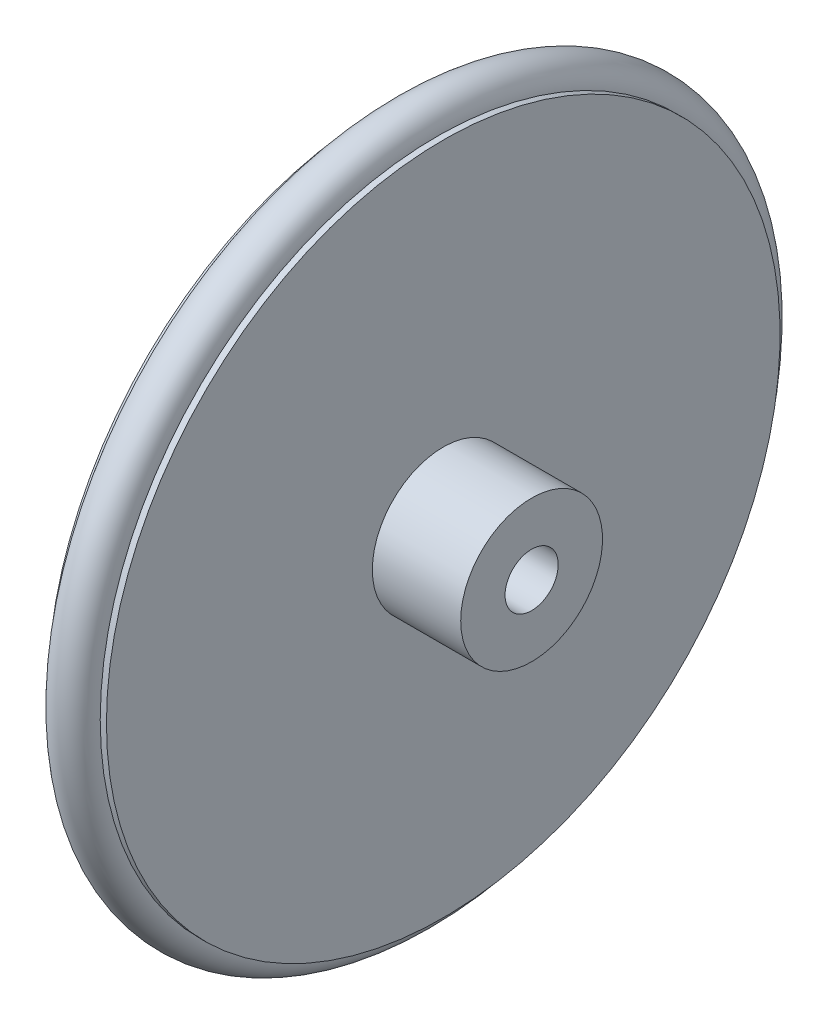
ISO-10303-21;
HEADER;
FILE_DESCRIPTION(('STEP AP214'),'2;1');
FILE_NAME('part.step','',(''),(''),'','','');
FILE_SCHEMA(('AUTOMOTIVE_DESIGN { 1 0 10303 214 1 1 1 1 }'));
ENDSEC;
DATA;
#1=APPLICATION_CONTEXT('core data for automotive mechanical design processes');
#2=APPLICATION_PROTOCOL_DEFINITION('international standard','automotive_design',2000,#1);
#3=PRODUCT_CONTEXT('',#1,'mechanical');
#4=PRODUCT('Part','Part','',(#3));
#5=PRODUCT_RELATED_PRODUCT_CATEGORY('part','',(#4));
#6=PRODUCT_DEFINITION_FORMATION('','',#4);
#7=PRODUCT_DEFINITION_CONTEXT('part definition',#1,'design');
#8=PRODUCT_DEFINITION('design','',#6,#7);
#9=PRODUCT_DEFINITION_SHAPE('','',#8);
#10=(LENGTH_UNIT() NAMED_UNIT(*) SI_UNIT(.MILLI.,.METRE.));
#11=(NAMED_UNIT(*) PLANE_ANGLE_UNIT() SI_UNIT($,.RADIAN.));
#12=(NAMED_UNIT(*) SI_UNIT($,.STERADIAN.) SOLID_ANGLE_UNIT());
#13=UNCERTAINTY_MEASURE_WITH_UNIT(LENGTH_MEASURE(1.E-05),#10,'distance_accuracy_value','');
#14=(GEOMETRIC_REPRESENTATION_CONTEXT(3) GLOBAL_UNCERTAINTY_ASSIGNED_CONTEXT((#13)) GLOBAL_UNIT_ASSIGNED_CONTEXT((#10,
#11,#12)) REPRESENTATION_CONTEXT('',''));
#15=CARTESIAN_POINT('',(0.,0.,0.));
#16=DIRECTION('',(0.,0.,1.));
#17=DIRECTION('',(1.,0.,0.));
#18=AXIS2_PLACEMENT_3D('',#15,#16,#17);
#19=CARTESIAN_POINT('',(3.30000000000003,0.,0.));
#20=DIRECTION('',(-1.,0.,0.));
#21=DIRECTION('',(0.,0.,1.));
#22=AXIS2_PLACEMENT_3D('',#19,#20,#21);
#23=TOROIDAL_SURFACE('',#22,38.,2.5);
#24=CARTESIAN_POINT('',(3.30000000000003,38.,0.));
#25=DIRECTION('',(0.,0.,1.));
#26=DIRECTION('',(1.,0.,0.));
#27=AXIS2_PLACEMENT_3D('',#24,#25,#26);
#28=CIRCLE('',#27,2.5);
#29=CARTESIAN_POINT('',(3.30000000000003,40.5,0.));
#30=VERTEX_POINT('',#29);
#31=EDGE_CURVE('E11',#30,#30,#28,.T.);
#32=CARTESIAN_POINT('',(3.30000000000003,0.,0.));
#33=DIRECTION('',(-1.,0.,0.));
#34=DIRECTION('',(0.,0.,1.));
#35=AXIS2_PLACEMENT_3D('',#32,#33,#34);
#36=CIRCLE('',#35,40.5);
#37=EDGE_CURVE('',#30,#30,#36,.T.);
#38=ORIENTED_EDGE('',*,*,#31,.F.);
#39=ORIENTED_EDGE('',*,*,#31,.T.);
#40=ORIENTED_EDGE('',*,*,#37,.T.);
#41=ORIENTED_EDGE('',*,*,#37,.F.);
#42=EDGE_LOOP('',(#38,#40,#39,#41));
#43=FACE_BOUND('',#42,.T.);
#44=ADVANCED_FACE('F41',(#43),#23,.T.);
#45=CLOSED_SHELL('',(#44));
#46=MANIFOLD_SOLID_BREP('B2',#45);
#47=CARTESIAN_POINT('',(0.,38.,0.));
#48=DIRECTION('',(1.,0.,0.));
#49=DIRECTION('',(0.,0.,-1.));
#50=AXIS2_PLACEMENT_3D('',#47,#48,#49);
#51=PLANE('',#50);
#52=CARTESIAN_POINT('',(0.,0.,0.));
#53=DIRECTION('',(1.,0.,0.));
#54=DIRECTION('',(0.,0.,-1.));
#55=AXIS2_PLACEMENT_3D('',#52,#53,#54);
#56=CIRCLE('',#55,3.);
#57=CARTESIAN_POINT('',(0.,0.,-3.));
#58=VERTEX_POINT('',#57);
#59=EDGE_CURVE('E101',#58,#58,#56,.T.);
#60=ORIENTED_EDGE('',*,*,#59,.T.);
#61=EDGE_LOOP('',(#60));
#62=FACE_BOUND('',#61,.T.);
#63=CARTESIAN_POINT('',(0.,0.,0.));
#64=DIRECTION('',(-1.,0.,0.));
#65=DIRECTION('',(0.,0.,1.));
#66=AXIS2_PLACEMENT_3D('',#63,#64,#65);
#67=CIRCLE('',#66,38.);
#68=CARTESIAN_POINT('',(0.,0.,38.));
#69=VERTEX_POINT('',#68);
#70=EDGE_CURVE('E98',#69,#69,#67,.T.);
#71=ORIENTED_EDGE('',*,*,#70,.T.);
#72=EDGE_LOOP('',(#71));
#73=FACE_BOUND('',#72,.T.);
#74=ADVANCED_FACE('F70',(#62,#73),#51,.F.);
#75=CARTESIAN_POINT('',(16.57,0.,0.));
#76=DIRECTION('',(-1.,0.,0.));
#77=DIRECTION('',(0.,0.,1.));
#78=AXIS2_PLACEMENT_3D('',#75,#76,#77);
#79=PLANE('',#78);
#80=CARTESIAN_POINT('',(16.57,0.,0.));
#81=DIRECTION('',(1.,0.,0.));
#82=DIRECTION('',(0.,0.,-1.));
#83=AXIS2_PLACEMENT_3D('',#80,#81,#82);
#84=CIRCLE('',#83,3.);
#85=CARTESIAN_POINT('',(16.57,0.,-3.));
#86=VERTEX_POINT('',#85);
#87=EDGE_CURVE('E102',#86,#86,#84,.T.);
#88=ORIENTED_EDGE('',*,*,#87,.F.);
#89=EDGE_LOOP('',(#88));
#90=FACE_BOUND('',#89,.T.);
#91=CARTESIAN_POINT('',(16.57,0.,0.));
#92=DIRECTION('',(-1.,0.,0.));
#93=DIRECTION('',(0.,0.,1.));
#94=AXIS2_PLACEMENT_3D('',#91,#92,#93);
#95=CIRCLE('',#94,8.);
#96=CARTESIAN_POINT('',(16.57,0.,8.));
#97=VERTEX_POINT('',#96);
#98=EDGE_CURVE('E40',#97,#97,#95,.T.);
#99=ORIENTED_EDGE('',*,*,#98,.F.);
#100=EDGE_LOOP('',(#99));
#101=FACE_BOUND('',#100,.T.);
#102=ADVANCED_FACE('F117',(#90,#101),#79,.F.);
#103=CARTESIAN_POINT('',(-19.9450853035614,0.,0.));
#104=DIRECTION('',(-1.,0.,0.));
#105=DIRECTION('',(0.,0.,1.));
#106=AXIS2_PLACEMENT_3D('',#103,#104,#105);
#107=CYLINDRICAL_SURFACE('',#106,8.);
#108=CARTESIAN_POINT('',(6.6,0.,0.));
#109=DIRECTION('',(-1.,0.,0.));
#110=DIRECTION('',(0.,0.,1.));
#111=AXIS2_PLACEMENT_3D('',#108,#109,#110);
#112=CIRCLE('',#111,8.);
#113=CARTESIAN_POINT('',(6.6,0.,8.));
#114=VERTEX_POINT('',#113);
#115=EDGE_CURVE('E76',#114,#114,#112,.T.);
#116=ORIENTED_EDGE('',*,*,#115,.F.);
#117=EDGE_LOOP('',(#116));
#118=FACE_BOUND('',#117,.T.);
#119=ORIENTED_EDGE('',*,*,#98,.T.);
#120=EDGE_LOOP('',(#119));
#121=FACE_BOUND('',#120,.T.);
#122=ADVANCED_FACE('F120',(#118,#121),#107,.T.);
#123=CARTESIAN_POINT('',(6.6,8.,0.));
#124=DIRECTION('',(-1.,0.,0.));
#125=DIRECTION('',(0.,0.,1.));
#126=AXIS2_PLACEMENT_3D('',#123,#124,#125);
#127=PLANE('',#126);
#128=CARTESIAN_POINT('',(6.6,0.,0.));
#129=DIRECTION('',(-1.,0.,0.));
#130=DIRECTION('',(0.,0.,1.));
#131=AXIS2_PLACEMENT_3D('',#128,#129,#130);
#132=CIRCLE('',#131,38.);
#133=CARTESIAN_POINT('',(6.6,0.,38.));
#134=VERTEX_POINT('',#133);
#135=EDGE_CURVE('E80',#134,#134,#132,.T.);
#136=ORIENTED_EDGE('',*,*,#135,.F.);
#137=EDGE_LOOP('',(#136));
#138=FACE_BOUND('',#137,.T.);
#139=ORIENTED_EDGE('',*,*,#115,.T.);
#140=EDGE_LOOP('',(#139));
#141=FACE_BOUND('',#140,.T.);
#142=ADVANCED_FACE('F125',(#138,#141),#127,.F.);
#143=CARTESIAN_POINT('',(-19.9450853035614,0.,0.));
#144=DIRECTION('',(-1.,0.,0.));
#145=DIRECTION('',(0.,0.,1.));
#146=AXIS2_PLACEMENT_3D('',#143,#144,#145);
#147=CYLINDRICAL_SURFACE('',#146,38.);
#148=CARTESIAN_POINT('',(5.9,0.,0.));
#149=DIRECTION('',(-1.,0.,0.));
#150=DIRECTION('',(0.,0.,1.));
#151=AXIS2_PLACEMENT_3D('',#148,#149,#150);
#152=CIRCLE('',#151,38.);
#153=CARTESIAN_POINT('',(5.9,0.,38.));
#154=VERTEX_POINT('',#153);
#155=EDGE_CURVE('E84',#154,#154,#152,.T.);
#156=ORIENTED_EDGE('',*,*,#155,.F.);
#157=EDGE_LOOP('',(#156));
#158=FACE_BOUND('',#157,.T.);
#159=ORIENTED_EDGE('',*,*,#135,.T.);
#160=EDGE_LOOP('',(#159));
#161=FACE_BOUND('',#160,.T.);
#162=ADVANCED_FACE('F131',(#158,#161),#147,.T.);
#163=CARTESIAN_POINT('',(5.90000000000003,38.,0.));
#164=DIRECTION('',(1.,0.,0.));
#165=DIRECTION('',(0.,0.,-1.));
#166=AXIS2_PLACEMENT_3D('',#163,#164,#165);
#167=PLANE('',#166);
#168=CARTESIAN_POINT('',(5.90000000000004,0.,0.));
#169=DIRECTION('',(-1.,0.,0.));
#170=DIRECTION('',(0.,0.,1.));
#171=AXIS2_PLACEMENT_3D('',#168,#169,#170);
#172=CIRCLE('',#171,35.);
#173=CARTESIAN_POINT('',(5.90000000000004,0.,35.));
#174=VERTEX_POINT('',#173);
#175=EDGE_CURVE('E89',#174,#174,#172,.T.);
#176=ORIENTED_EDGE('',*,*,#175,.F.);
#177=EDGE_LOOP('',(#176));
#178=FACE_BOUND('',#177,.T.);
#179=ORIENTED_EDGE('',*,*,#155,.T.);
#180=EDGE_LOOP('',(#179));
#181=FACE_BOUND('',#180,.T.);
#182=ADVANCED_FACE('F135',(#178,#181),#167,.F.);
#183=CARTESIAN_POINT('',(-19.9450853035614,0.,0.));
#184=DIRECTION('',(-1.,0.,0.));
#185=DIRECTION('',(0.,0.,1.));
#186=AXIS2_PLACEMENT_3D('',#183,#184,#185);
#187=CYLINDRICAL_SURFACE('',#186,35.);
#188=CARTESIAN_POINT('',(0.700000000000041,0.,0.));
#189=DIRECTION('',(-1.,0.,0.));
#190=DIRECTION('',(0.,0.,1.));
#191=AXIS2_PLACEMENT_3D('',#188,#189,#190);
#192=CIRCLE('',#191,35.);
#193=CARTESIAN_POINT('',(0.700000000000041,0.,35.));
#194=VERTEX_POINT('',#193);
#195=EDGE_CURVE('E92',#194,#194,#192,.T.);
#196=ORIENTED_EDGE('',*,*,#195,.F.);
#197=EDGE_LOOP('',(#196));
#198=FACE_BOUND('',#197,.T.);
#199=ORIENTED_EDGE('',*,*,#175,.T.);
#200=EDGE_LOOP('',(#199));
#201=FACE_BOUND('',#200,.T.);
#202=ADVANCED_FACE('F139',(#198,#201),#187,.T.);
#203=CARTESIAN_POINT('',(0.700000000000042,35.,0.));
#204=DIRECTION('',(-1.,0.,0.));
#205=DIRECTION('',(0.,0.,1.));
#206=AXIS2_PLACEMENT_3D('',#203,#204,#205);
#207=PLANE('',#206);
#208=CARTESIAN_POINT('',(0.700000000000041,0.,0.));
#209=DIRECTION('',(-1.,0.,0.));
#210=DIRECTION('',(0.,0.,1.));
#211=AXIS2_PLACEMENT_3D('',#208,#209,#210);
#212=CIRCLE('',#211,38.);
#213=CARTESIAN_POINT('',(0.700000000000041,0.,38.));
#214=VERTEX_POINT('',#213);
#215=EDGE_CURVE('E95',#214,#214,#212,.T.);
#216=ORIENTED_EDGE('',*,*,#215,.F.);
#217=EDGE_LOOP('',(#216));
#218=FACE_BOUND('',#217,.T.);
#219=ORIENTED_EDGE('',*,*,#195,.T.);
#220=EDGE_LOOP('',(#219));
#221=FACE_BOUND('',#220,.T.);
#222=ADVANCED_FACE('F143',(#218,#221),#207,.F.);
#223=CARTESIAN_POINT('',(-19.9450853035614,0.,0.));
#224=DIRECTION('',(-1.,0.,0.));
#225=DIRECTION('',(0.,0.,1.));
#226=AXIS2_PLACEMENT_3D('',#223,#224,#225);
#227=CYLINDRICAL_SURFACE('',#226,38.);
#228=ORIENTED_EDGE('',*,*,#70,.F.);
#229=EDGE_LOOP('',(#228));
#230=FACE_BOUND('',#229,.T.);
#231=ORIENTED_EDGE('',*,*,#215,.T.);
#232=EDGE_LOOP('',(#231));
#233=FACE_BOUND('',#232,.T.);
#234=ADVANCED_FACE('F113',(#230,#233),#227,.T.);
#235=CARTESIAN_POINT('',(0.,0.,0.));
#236=DIRECTION('',(1.,0.,0.));
#237=DIRECTION('',(0.,0.,-1.));
#238=AXIS2_PLACEMENT_3D('',#235,#236,#237);
#239=CYLINDRICAL_SURFACE('',#238,3.);
#240=ORIENTED_EDGE('',*,*,#59,.F.);
#241=EDGE_LOOP('',(#240));
#242=FACE_BOUND('',#241,.T.);
#243=ORIENTED_EDGE('',*,*,#87,.T.);
#244=EDGE_LOOP('',(#243));
#245=FACE_BOUND('',#244,.T.);
#246=ADVANCED_FACE('F110',(#242,#245),#239,.F.);
#247=CLOSED_SHELL('',(#74,#102,#122,#142,#162,#182,#202,#222,#234,#246));
#248=MANIFOLD_SOLID_BREP('B6',#247);
#249=ADVANCED_BREP_SHAPE_REPRESENTATION('',(#18,#46,#248),#14);
#250=SHAPE_DEFINITION_REPRESENTATION(#9,#249);
ENDSEC;
END-ISO-10303-21;
